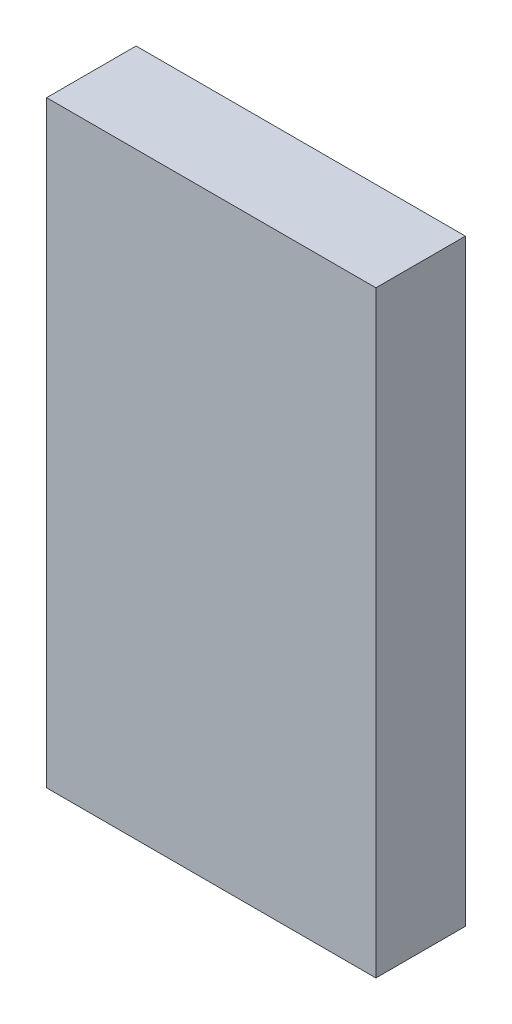
ISO-10303-21;
HEADER;
FILE_DESCRIPTION(('STEP AP214'),'2;1');
FILE_NAME('part.step','',(''),(''),'','','');
FILE_SCHEMA(('AUTOMOTIVE_DESIGN { 1 0 10303 214 1 1 1 1 }'));
ENDSEC;
DATA;
#1=APPLICATION_CONTEXT('core data for automotive mechanical design processes');
#2=APPLICATION_PROTOCOL_DEFINITION('international standard','automotive_design',2000,#1);
#3=PRODUCT_CONTEXT('',#1,'mechanical');
#4=PRODUCT('Part','Part','',(#3));
#5=PRODUCT_RELATED_PRODUCT_CATEGORY('part','',(#4));
#6=PRODUCT_DEFINITION_FORMATION('','',#4);
#7=PRODUCT_DEFINITION_CONTEXT('part definition',#1,'design');
#8=PRODUCT_DEFINITION('design','',#6,#7);
#9=PRODUCT_DEFINITION_SHAPE('','',#8);
#10=(LENGTH_UNIT() NAMED_UNIT(*) SI_UNIT(.MILLI.,.METRE.));
#11=(NAMED_UNIT(*) PLANE_ANGLE_UNIT() SI_UNIT($,.RADIAN.));
#12=(NAMED_UNIT(*) SI_UNIT($,.STERADIAN.) SOLID_ANGLE_UNIT());
#13=UNCERTAINTY_MEASURE_WITH_UNIT(LENGTH_MEASURE(1.E-05),#10,'distance_accuracy_value','');
#14=(GEOMETRIC_REPRESENTATION_CONTEXT(3) GLOBAL_UNCERTAINTY_ASSIGNED_CONTEXT((#13)) GLOBAL_UNIT_ASSIGNED_CONTEXT((#10,
#11,#12)) REPRESENTATION_CONTEXT('',''));
#15=CARTESIAN_POINT('',(0.,0.,0.));
#16=DIRECTION('',(0.,0.,1.));
#17=DIRECTION('',(1.,0.,0.));
#18=AXIS2_PLACEMENT_3D('',#15,#16,#17);
#19=CARTESIAN_POINT('',(0.806,0.771,0.));
#20=DIRECTION('',(1.,0.,0.));
#21=DIRECTION('',(0.,0.,1.));
#22=AXIS2_PLACEMENT_3D('',#19,#20,#21);
#23=PLANE('',#22);
#24=DIRECTION('',(0.,1.,0.));
#25=VECTOR('',#24,1.);
#26=CARTESIAN_POINT('',(0.806,0.771,0.1));
#27=LINE('',#26,#25);
#28=CARTESIAN_POINT('',(0.806,0.771,0.1));
#29=VERTEX_POINT('',#28);
#30=CARTESIAN_POINT('',(0.806,1.439,0.1));
#31=VERTEX_POINT('',#30);
#32=EDGE_CURVE('E11',#29,#31,#27,.T.);
#33=ORIENTED_EDGE('',*,*,#32,.T.);
#34=DIRECTION('',(0.,0.,1.));
#35=VECTOR('',#34,1.);
#36=CARTESIAN_POINT('',(0.806,1.439,0.));
#37=LINE('',#36,#35);
#38=CARTESIAN_POINT('',(0.806,1.439,0.));
#39=VERTEX_POINT('',#38);
#40=EDGE_CURVE('E24',#39,#31,#37,.T.);
#41=ORIENTED_EDGE('',*,*,#40,.F.);
#42=DIRECTION('',(0.,1.,0.));
#43=VECTOR('',#42,1.);
#44=CARTESIAN_POINT('',(0.806,0.771,0.));
#45=LINE('',#44,#43);
#46=CARTESIAN_POINT('',(0.806,0.771,0.));
#47=VERTEX_POINT('',#46);
#48=EDGE_CURVE('E86',#47,#39,#45,.T.);
#49=ORIENTED_EDGE('',*,*,#48,.F.);
#50=DIRECTION('',(0.,0.,1.));
#51=VECTOR('',#50,1.);
#52=CARTESIAN_POINT('',(0.806,0.771,0.));
#53=LINE('',#52,#51);
#54=EDGE_CURVE('E36',#47,#29,#53,.T.);
#55=ORIENTED_EDGE('',*,*,#54,.T.);
#56=EDGE_LOOP('',(#33,#41,#49,#55));
#57=FACE_BOUND('',#56,.T.);
#58=ADVANCED_FACE('F17',(#57),#23,.F.);
#59=CARTESIAN_POINT('',(1.174,0.771,0.));
#60=DIRECTION('',(1.,0.,0.));
#61=DIRECTION('',(0.,0.,1.));
#62=AXIS2_PLACEMENT_3D('',#59,#60,#61);
#63=PLANE('',#62);
#64=DIRECTION('',(0.,0.,1.));
#65=VECTOR('',#64,1.);
#66=CARTESIAN_POINT('',(1.174,0.771,0.));
#67=LINE('',#66,#65);
#68=CARTESIAN_POINT('',(1.174,0.771,0.));
#69=VERTEX_POINT('',#68);
#70=CARTESIAN_POINT('',(1.174,0.771,0.1));
#71=VERTEX_POINT('',#70);
#72=EDGE_CURVE('E83',#69,#71,#67,.T.);
#73=ORIENTED_EDGE('',*,*,#72,.F.);
#74=DIRECTION('',(0.,1.,0.));
#75=VECTOR('',#74,1.);
#76=CARTESIAN_POINT('',(1.174,0.771,0.));
#77=LINE('',#76,#75);
#78=CARTESIAN_POINT('',(1.174,1.439,0.));
#79=VERTEX_POINT('',#78);
#80=EDGE_CURVE('E63',#69,#79,#77,.T.);
#81=ORIENTED_EDGE('',*,*,#80,.T.);
#82=DIRECTION('',(0.,0.,1.));
#83=VECTOR('',#82,1.);
#84=CARTESIAN_POINT('',(1.174,1.439,0.));
#85=LINE('',#84,#83);
#86=CARTESIAN_POINT('',(1.174,1.439,0.1));
#87=VERTEX_POINT('',#86);
#88=EDGE_CURVE('E57',#79,#87,#85,.T.);
#89=ORIENTED_EDGE('',*,*,#88,.T.);
#90=DIRECTION('',(0.,1.,0.));
#91=VECTOR('',#90,1.);
#92=CARTESIAN_POINT('',(1.174,0.771,0.1));
#93=LINE('',#92,#91);
#94=EDGE_CURVE('E60',#71,#87,#93,.T.);
#95=ORIENTED_EDGE('',*,*,#94,.F.);
#96=EDGE_LOOP('',(#73,#81,#89,#95));
#97=FACE_BOUND('',#96,.T.);
#98=ADVANCED_FACE('F59',(#97),#63,.T.);
#99=CARTESIAN_POINT('',(0.806,0.771,0.));
#100=DIRECTION('',(0.,1.,0.));
#101=DIRECTION('',(0.,0.,1.));
#102=AXIS2_PLACEMENT_3D('',#99,#100,#101);
#103=PLANE('',#102);
#104=ORIENTED_EDGE('',*,*,#72,.T.);
#105=DIRECTION('',(1.,0.,0.));
#106=VECTOR('',#105,1.);
#107=CARTESIAN_POINT('',(0.806,0.771,0.1));
#108=LINE('',#107,#106);
#109=EDGE_CURVE('E71',#29,#71,#108,.T.);
#110=ORIENTED_EDGE('',*,*,#109,.F.);
#111=ORIENTED_EDGE('',*,*,#54,.F.);
#112=DIRECTION('',(1.,0.,0.));
#113=VECTOR('',#112,1.);
#114=CARTESIAN_POINT('',(0.806,0.771,0.));
#115=LINE('',#114,#113);
#116=EDGE_CURVE('E76',#47,#69,#115,.T.);
#117=ORIENTED_EDGE('',*,*,#116,.T.);
#118=EDGE_LOOP('',(#104,#110,#111,#117));
#119=FACE_BOUND('',#118,.T.);
#120=ADVANCED_FACE('F91',(#119),#103,.F.);
#121=CARTESIAN_POINT('',(0.806,1.439,0.));
#122=DIRECTION('',(0.,1.,0.));
#123=DIRECTION('',(0.,0.,1.));
#124=AXIS2_PLACEMENT_3D('',#121,#122,#123);
#125=PLANE('',#124);
#126=DIRECTION('',(1.,0.,0.));
#127=VECTOR('',#126,1.);
#128=CARTESIAN_POINT('',(0.806,1.439,0.));
#129=LINE('',#128,#127);
#130=EDGE_CURVE('E74',#39,#79,#129,.T.);
#131=ORIENTED_EDGE('',*,*,#130,.F.);
#132=ORIENTED_EDGE('',*,*,#40,.T.);
#133=DIRECTION('',(1.,0.,0.));
#134=VECTOR('',#133,1.);
#135=CARTESIAN_POINT('',(0.806,1.439,0.1));
#136=LINE('',#135,#134);
#137=EDGE_CURVE('E69',#31,#87,#136,.T.);
#138=ORIENTED_EDGE('',*,*,#137,.T.);
#139=ORIENTED_EDGE('',*,*,#88,.F.);
#140=EDGE_LOOP('',(#131,#132,#138,#139));
#141=FACE_BOUND('',#140,.T.);
#142=ADVANCED_FACE('F73',(#141),#125,.T.);
#143=CARTESIAN_POINT('',(0.806,0.771,0.));
#144=DIRECTION('',(0.,0.,1.));
#145=DIRECTION('',(1.,0.,0.));
#146=AXIS2_PLACEMENT_3D('',#143,#144,#145);
#147=PLANE('',#146);
#148=ORIENTED_EDGE('',*,*,#130,.T.);
#149=ORIENTED_EDGE('',*,*,#80,.F.);
#150=ORIENTED_EDGE('',*,*,#116,.F.);
#151=ORIENTED_EDGE('',*,*,#48,.T.);
#152=EDGE_LOOP('',(#148,#149,#150,#151));
#153=FACE_BOUND('',#152,.T.);
#154=ADVANCED_FACE('F89',(#153),#147,.F.);
#155=CARTESIAN_POINT('',(0.806,0.771,0.1));
#156=DIRECTION('',(0.,0.,1.));
#157=DIRECTION('',(1.,0.,0.));
#158=AXIS2_PLACEMENT_3D('',#155,#156,#157);
#159=PLANE('',#158);
#160=ORIENTED_EDGE('',*,*,#32,.F.);
#161=ORIENTED_EDGE('',*,*,#109,.T.);
#162=ORIENTED_EDGE('',*,*,#94,.T.);
#163=ORIENTED_EDGE('',*,*,#137,.F.);
#164=EDGE_LOOP('',(#160,#161,#162,#163));
#165=FACE_BOUND('',#164,.T.);
#166=ADVANCED_FACE('F68',(#165),#159,.T.);
#167=CLOSED_SHELL('',(#58,#98,#120,#142,#154,#166));
#168=MANIFOLD_SOLID_BREP('B1',#167);
#169=ADVANCED_BREP_SHAPE_REPRESENTATION('',(#18,#168),#14);
#170=SHAPE_DEFINITION_REPRESENTATION(#9,#169);
ENDSEC;
END-ISO-10303-21;
